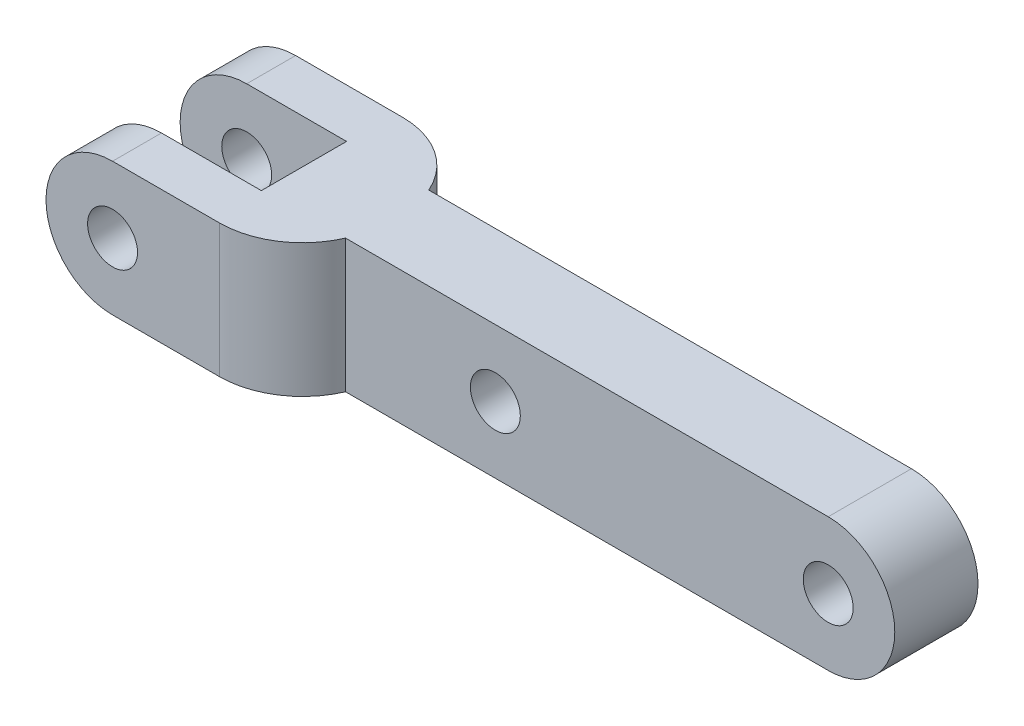
ISO-10303-21;
HEADER;
FILE_DESCRIPTION(('STEP AP214'),'2;1');
FILE_NAME('part.step','',(''),(''),'','','');
FILE_SCHEMA(('AUTOMOTIVE_DESIGN { 1 0 10303 214 1 1 1 1 }'));
ENDSEC;
DATA;
#1=APPLICATION_CONTEXT('core data for automotive mechanical design processes');
#2=APPLICATION_PROTOCOL_DEFINITION('international standard','automotive_design',2000,#1);
#3=PRODUCT_CONTEXT('',#1,'mechanical');
#4=PRODUCT('Part','Part','',(#3));
#5=PRODUCT_RELATED_PRODUCT_CATEGORY('part','',(#4));
#6=PRODUCT_DEFINITION_FORMATION('','',#4);
#7=PRODUCT_DEFINITION_CONTEXT('part definition',#1,'design');
#8=PRODUCT_DEFINITION('design','',#6,#7);
#9=PRODUCT_DEFINITION_SHAPE('','',#8);
#10=(LENGTH_UNIT() NAMED_UNIT(*) SI_UNIT(.MILLI.,.METRE.));
#11=(NAMED_UNIT(*) PLANE_ANGLE_UNIT() SI_UNIT($,.RADIAN.));
#12=(NAMED_UNIT(*) SI_UNIT($,.STERADIAN.) SOLID_ANGLE_UNIT());
#13=UNCERTAINTY_MEASURE_WITH_UNIT(LENGTH_MEASURE(1.E-05),#10,'distance_accuracy_value','');
#14=(GEOMETRIC_REPRESENTATION_CONTEXT(3) GLOBAL_UNCERTAINTY_ASSIGNED_CONTEXT((#13)) GLOBAL_UNIT_ASSIGNED_CONTEXT((#10,
#11,#12)) REPRESENTATION_CONTEXT('',''));
#15=CARTESIAN_POINT('',(0.,0.,0.));
#16=DIRECTION('',(0.,0.,1.));
#17=DIRECTION('',(1.,0.,0.));
#18=AXIS2_PLACEMENT_3D('',#15,#16,#17);
#19=CARTESIAN_POINT('',(-55.3769834102762,0.,0.));
#20=DIRECTION('',(0.,0.,1.));
#21=DIRECTION('',(1.,0.,0.));
#22=AXIS2_PLACEMENT_3D('',#19,#20,#21);
#23=CYLINDRICAL_SURFACE('',#22,4.);
#24=DIRECTION('',(0.,0.,1.));
#25=VECTOR('',#24,1.);
#26=CARTESIAN_POINT('',(-55.3769834102762,-4.,0.));
#27=LINE('',#26,#25);
#28=CARTESIAN_POINT('',(-55.3769834102762,-4.,-3.));
#29=VERTEX_POINT('',#28);
#30=CARTESIAN_POINT('',(-55.3769834102762,-4.,-0.0600000000000014));
#31=VERTEX_POINT('',#30);
#32=EDGE_CURVE('E218',#29,#31,#27,.T.);
#33=ORIENTED_EDGE('',*,*,#32,.T.);
#34=CARTESIAN_POINT('',(-55.3769834102762,0.,-0.0600000000000014));
#35=DIRECTION('',(0.,0.,-1.));
#36=DIRECTION('',(-1.,0.,0.));
#37=AXIS2_PLACEMENT_3D('',#34,#35,#36);
#38=CIRCLE('',#37,4.);
#39=CARTESIAN_POINT('',(-55.3769834102762,4.,-0.0600000000000014));
#40=VERTEX_POINT('',#39);
#41=EDGE_CURVE('E172',#40,#31,#38,.F.);
#42=ORIENTED_EDGE('',*,*,#41,.F.);
#43=DIRECTION('',(0.,0.,1.));
#44=VECTOR('',#43,1.);
#45=CARTESIAN_POINT('',(-55.3769834102762,3.99999999999999,0.));
#46=LINE('',#45,#44);
#47=CARTESIAN_POINT('',(-55.3769834102762,3.99999999999999,-3.));
#48=VERTEX_POINT('',#47);
#49=EDGE_CURVE('E224',#48,#40,#46,.T.);
#50=ORIENTED_EDGE('',*,*,#49,.F.);
#51=CARTESIAN_POINT('',(-55.3769834102762,0.,-3.));
#52=DIRECTION('',(0.,0.,1.));
#53=DIRECTION('',(1.,0.,0.));
#54=AXIS2_PLACEMENT_3D('',#51,#52,#53);
#55=CIRCLE('',#54,4.);
#56=EDGE_CURVE('E184',#48,#29,#55,.T.);
#57=ORIENTED_EDGE('',*,*,#56,.T.);
#58=EDGE_LOOP('',(#33,#42,#50,#57));
#59=FACE_BOUND('',#58,.T.);
#60=ADVANCED_FACE('F41',(#59),#23,.T.);
#61=CARTESIAN_POINT('',(-55.3769834102762,0.,0.));
#62=DIRECTION('',(0.,0.,1.));
#63=DIRECTION('',(1.,0.,0.));
#64=AXIS2_PLACEMENT_3D('',#61,#62,#63);
#65=CYLINDRICAL_SURFACE('',#64,1.5);
#66=CARTESIAN_POINT('',(-55.3769834102762,0.,-0.0600000000000014));
#67=DIRECTION('',(0.,0.,-1.));
#68=DIRECTION('',(-1.,0.,0.));
#69=AXIS2_PLACEMENT_3D('',#66,#67,#68);
#70=CIRCLE('',#69,1.5);
#71=CARTESIAN_POINT('',(-56.8769834102762,0.,-0.0600000000000012));
#72=VERTEX_POINT('',#71);
#73=EDGE_CURVE('E171',#72,#72,#70,.F.);
#74=ORIENTED_EDGE('',*,*,#73,.T.);
#75=EDGE_LOOP('',(#74));
#76=FACE_BOUND('',#75,.T.);
#77=CARTESIAN_POINT('',(-55.3769834102762,0.,-3.));
#78=DIRECTION('',(0.,0.,1.));
#79=DIRECTION('',(1.,0.,0.));
#80=AXIS2_PLACEMENT_3D('',#77,#78,#79);
#81=CIRCLE('',#80,1.5);
#82=CARTESIAN_POINT('',(-53.8769834102762,0.,-3.));
#83=VERTEX_POINT('',#82);
#84=EDGE_CURVE('E192',#83,#83,#81,.F.);
#85=ORIENTED_EDGE('',*,*,#84,.T.);
#86=EDGE_LOOP('',(#85));
#87=FACE_BOUND('',#86,.T.);
#88=ADVANCED_FACE('F323',(#76,#87),#65,.F.);
#89=CARTESIAN_POINT('',(-35.3769834102762,0.,5.));
#90=DIRECTION('',(0.,0.,1.));
#91=DIRECTION('',(1.,0.,0.));
#92=AXIS2_PLACEMENT_3D('',#89,#90,#91);
#93=PLANE('',#92);
#94=DIRECTION('',(0.,1.,0.));
#95=VECTOR('',#94,1.);
#96=CARTESIAN_POINT('',(-44.3769834102762,0.,5.));
#97=LINE('',#96,#95);
#98=CARTESIAN_POINT('',(-44.3769834102762,-4.,5.));
#99=VERTEX_POINT('',#98);
#100=CARTESIAN_POINT('',(-44.3769834102762,4.,5.));
#101=VERTEX_POINT('',#100);
#102=EDGE_CURVE('E213',#99,#101,#97,.T.);
#103=ORIENTED_EDGE('',*,*,#102,.F.);
#104=DIRECTION('',(1.,0.,0.));
#105=VECTOR('',#104,1.);
#106=CARTESIAN_POINT('',(-35.3769834102762,-4.,5.));
#107=LINE('',#106,#105);
#108=CARTESIAN_POINT('',(-15.3769834102762,-4.,5.));
#109=VERTEX_POINT('',#108);
#110=EDGE_CURVE('E243',#99,#109,#107,.T.);
#111=ORIENTED_EDGE('',*,*,#110,.T.);
#112=CARTESIAN_POINT('',(-15.3769834102762,0.,5.));
#113=DIRECTION('',(0.,0.,1.));
#114=DIRECTION('',(1.,0.,0.));
#115=AXIS2_PLACEMENT_3D('',#112,#113,#114);
#116=CIRCLE('',#115,4.);
#117=CARTESIAN_POINT('',(-15.3769834102762,4.,5.));
#118=VERTEX_POINT('',#117);
#119=EDGE_CURVE('E246',#109,#118,#116,.T.);
#120=ORIENTED_EDGE('',*,*,#119,.T.);
#121=DIRECTION('',(-1.,0.,0.));
#122=VECTOR('',#121,1.);
#123=CARTESIAN_POINT('',(-35.3769834102762,4.,5.));
#124=LINE('',#123,#122);
#125=EDGE_CURVE('E250',#118,#101,#124,.T.);
#126=ORIENTED_EDGE('',*,*,#125,.T.);
#127=EDGE_LOOP('',(#103,#111,#120,#126));
#128=FACE_BOUND('',#127,.T.);
#129=CARTESIAN_POINT('',(-35.3769834102762,0.,5.));
#130=DIRECTION('',(0.,0.,1.));
#131=DIRECTION('',(1.,0.,0.));
#132=AXIS2_PLACEMENT_3D('',#129,#130,#131);
#133=CIRCLE('',#132,1.5);
#134=CARTESIAN_POINT('',(-33.8769834102762,0.,5.));
#135=VERTEX_POINT('',#134);
#136=EDGE_CURVE('E235',#135,#135,#133,.T.);
#137=ORIENTED_EDGE('',*,*,#136,.F.);
#138=EDGE_LOOP('',(#137));
#139=FACE_BOUND('',#138,.T.);
#140=CARTESIAN_POINT('',(-15.3769834102762,0.,5.));
#141=DIRECTION('',(0.,0.,1.));
#142=DIRECTION('',(1.,0.,0.));
#143=AXIS2_PLACEMENT_3D('',#140,#141,#142);
#144=CIRCLE('',#143,1.5);
#145=CARTESIAN_POINT('',(-13.8769834102762,0.,5.));
#146=VERTEX_POINT('',#145);
#147=EDGE_CURVE('E227',#146,#146,#144,.T.);
#148=ORIENTED_EDGE('',*,*,#147,.F.);
#149=EDGE_LOOP('',(#148));
#150=FACE_BOUND('',#149,.T.);
#151=ADVANCED_FACE('F315',(#128,#139,#150),#93,.T.);
#152=CARTESIAN_POINT('',(-35.3769834102762,0.,0.));
#153=DIRECTION('',(0.,0.,1.));
#154=DIRECTION('',(1.,0.,0.));
#155=AXIS2_PLACEMENT_3D('',#152,#153,#154);
#156=PLANE('',#155);
#157=DIRECTION('',(1.,0.,0.));
#158=VECTOR('',#157,1.);
#159=CARTESIAN_POINT('',(-35.3769834102762,-4.,0.));
#160=LINE('',#159,#158);
#161=CARTESIAN_POINT('',(-44.3769834102762,-4.,0.));
#162=VERTEX_POINT('',#161);
#163=CARTESIAN_POINT('',(-15.3769834102762,-4.,0.));
#164=VERTEX_POINT('',#163);
#165=EDGE_CURVE('E239',#162,#164,#160,.T.);
#166=ORIENTED_EDGE('',*,*,#165,.F.);
#167=DIRECTION('',(0.,1.,0.));
#168=VECTOR('',#167,1.);
#169=CARTESIAN_POINT('',(-44.3769834102762,0.,0.));
#170=LINE('',#169,#168);
#171=CARTESIAN_POINT('',(-44.3769834102762,4.,0.));
#172=VERTEX_POINT('',#171);
#173=EDGE_CURVE('E210',#162,#172,#170,.T.);
#174=ORIENTED_EDGE('',*,*,#173,.T.);
#175=DIRECTION('',(-1.,0.,0.));
#176=VECTOR('',#175,1.);
#177=CARTESIAN_POINT('',(-35.3769834102762,4.,0.));
#178=LINE('',#177,#176);
#179=CARTESIAN_POINT('',(-15.3769834102762,4.,0.));
#180=VERTEX_POINT('',#179);
#181=EDGE_CURVE('E247',#180,#172,#178,.T.);
#182=ORIENTED_EDGE('',*,*,#181,.F.);
#183=CARTESIAN_POINT('',(-15.3769834102762,0.,0.));
#184=DIRECTION('',(0.,0.,1.));
#185=DIRECTION('',(1.,0.,0.));
#186=AXIS2_PLACEMENT_3D('',#183,#184,#185);
#187=CIRCLE('',#186,4.);
#188=EDGE_CURVE('E257',#164,#180,#187,.T.);
#189=ORIENTED_EDGE('',*,*,#188,.F.);
#190=EDGE_LOOP('',(#166,#174,#182,#189));
#191=FACE_BOUND('',#190,.T.);
#192=CARTESIAN_POINT('',(-35.3769834102762,0.,0.));
#193=DIRECTION('',(0.,0.,1.));
#194=DIRECTION('',(1.,0.,0.));
#195=AXIS2_PLACEMENT_3D('',#192,#193,#194);
#196=CIRCLE('',#195,1.5);
#197=CARTESIAN_POINT('',(-33.8769834102762,0.,0.));
#198=VERTEX_POINT('',#197);
#199=EDGE_CURVE('E231',#198,#198,#196,.T.);
#200=ORIENTED_EDGE('',*,*,#199,.T.);
#201=EDGE_LOOP('',(#200));
#202=FACE_BOUND('',#201,.T.);
#203=CARTESIAN_POINT('',(-15.3769834102762,0.,0.));
#204=DIRECTION('',(0.,0.,1.));
#205=DIRECTION('',(1.,0.,0.));
#206=AXIS2_PLACEMENT_3D('',#203,#204,#205);
#207=CIRCLE('',#206,1.5);
#208=CARTESIAN_POINT('',(-13.8769834102762,0.,0.));
#209=VERTEX_POINT('',#208);
#210=EDGE_CURVE('E222',#209,#209,#207,.T.);
#211=ORIENTED_EDGE('',*,*,#210,.T.);
#212=EDGE_LOOP('',(#211));
#213=FACE_BOUND('',#212,.T.);
#214=ADVANCED_FACE('F305',(#191,#202,#213),#156,.F.);
#215=CARTESIAN_POINT('',(-35.3769834102762,-4.,5.));
#216=DIRECTION('',(0.,1.,0.));
#217=DIRECTION('',(-1.,0.,0.));
#218=AXIS2_PLACEMENT_3D('',#215,#216,#217);
#219=PLANE('',#218);
#220=DIRECTION('',(1.,0.,0.));
#221=VECTOR('',#220,1.);
#222=CARTESIAN_POINT('',(0.,-4.,-3.));
#223=LINE('',#222,#221);
#224=CARTESIAN_POINT('',(-48.959559105232,-4.,-3.));
#225=VERTEX_POINT('',#224);
#226=EDGE_CURVE('E188',#29,#225,#223,.T.);
#227=ORIENTED_EDGE('',*,*,#226,.T.);
#228=CARTESIAN_POINT('',(-48.959559105232,-4.,2.));
#229=DIRECTION('',(0.,1.,0.));
#230=DIRECTION('',(-1.,0.,0.));
#231=AXIS2_PLACEMENT_3D('',#228,#229,#230);
#232=CIRCLE('',#231,5.);
#233=EDGE_CURVE('E281',#225,#162,#232,.F.);
#234=ORIENTED_EDGE('',*,*,#233,.T.);
#235=ORIENTED_EDGE('',*,*,#165,.T.);
#236=DIRECTION('',(0.,0.,-1.));
#237=VECTOR('',#236,1.);
#238=CARTESIAN_POINT('',(-15.3769834102762,-4.,5.));
#239=LINE('',#238,#237);
#240=EDGE_CURVE('E265',#109,#164,#239,.T.);
#241=ORIENTED_EDGE('',*,*,#240,.F.);
#242=ORIENTED_EDGE('',*,*,#110,.F.);
#243=CARTESIAN_POINT('',(-48.959559105232,-4.,3.));
#244=DIRECTION('',(0.,1.,0.));
#245=DIRECTION('',(-1.,0.,0.));
#246=AXIS2_PLACEMENT_3D('',#243,#244,#245);
#247=CIRCLE('',#246,5.);
#248=CARTESIAN_POINT('',(-48.959559105232,-4.,8.));
#249=VERTEX_POINT('',#248);
#250=EDGE_CURVE('E63',#99,#249,#247,.F.);
#251=ORIENTED_EDGE('',*,*,#250,.T.);
#252=DIRECTION('',(1.,0.,0.));
#253=VECTOR('',#252,1.);
#254=CARTESIAN_POINT('',(0.,-4.,8.));
#255=LINE('',#254,#253);
#256=CARTESIAN_POINT('',(-55.3769834102762,-4.,8.));
#257=VERTEX_POINT('',#256);
#258=EDGE_CURVE('E203',#257,#249,#255,.T.);
#259=ORIENTED_EDGE('',*,*,#258,.F.);
#260=CARTESIAN_POINT('',(-55.3769834102762,-4.,5.06));
#261=VERTEX_POINT('',#260);
#262=EDGE_CURVE('E223',#261,#257,#27,.T.);
#263=ORIENTED_EDGE('',*,*,#262,.F.);
#264=DIRECTION('',(1.,0.,0.));
#265=VECTOR('',#264,1.);
#266=CARTESIAN_POINT('',(-35.3769834102762,-4.,5.06));
#267=LINE('',#266,#265);
#268=CARTESIAN_POINT('',(-49.3769834102762,-4.,5.06));
#269=VERTEX_POINT('',#268);
#270=EDGE_CURVE('E168',#261,#269,#267,.T.);
#271=ORIENTED_EDGE('',*,*,#270,.T.);
#272=DIRECTION('',(0.,0.,-1.));
#273=VECTOR('',#272,1.);
#274=CARTESIAN_POINT('',(-49.3769834102762,-4.,5.));
#275=LINE('',#274,#273);
#276=CARTESIAN_POINT('',(-49.3769834102762,-4.,-0.0600000000000019));
#277=VERTEX_POINT('',#276);
#278=EDGE_CURVE('E138',#269,#277,#275,.T.);
#279=ORIENTED_EDGE('',*,*,#278,.T.);
#280=DIRECTION('',(-1.,0.,0.));
#281=VECTOR('',#280,1.);
#282=CARTESIAN_POINT('',(-35.3769834102762,-4.,-0.0600000000000028));
#283=LINE('',#282,#281);
#284=EDGE_CURVE('E175',#277,#31,#283,.T.);
#285=ORIENTED_EDGE('',*,*,#284,.T.);
#286=ORIENTED_EDGE('',*,*,#32,.F.);
#287=EDGE_LOOP('',(#227,#234,#235,#241,#242,#251,#259,#263,#271,#279,#285,#286));
#288=FACE_BOUND('',#287,.T.);
#289=ADVANCED_FACE('F301',(#288),#219,.F.);
#290=CARTESIAN_POINT('',(-15.3769834102762,0.,5.));
#291=DIRECTION('',(0.,0.,-1.));
#292=DIRECTION('',(-1.,0.,0.));
#293=AXIS2_PLACEMENT_3D('',#290,#291,#292);
#294=CYLINDRICAL_SURFACE('',#293,4.);
#295=ORIENTED_EDGE('',*,*,#188,.T.);
#296=DIRECTION('',(0.,0.,-1.));
#297=VECTOR('',#296,1.);
#298=CARTESIAN_POINT('',(-15.3769834102762,4.,5.));
#299=LINE('',#298,#297);
#300=EDGE_CURVE('E254',#118,#180,#299,.T.);
#301=ORIENTED_EDGE('',*,*,#300,.F.);
#302=ORIENTED_EDGE('',*,*,#119,.F.);
#303=ORIENTED_EDGE('',*,*,#240,.T.);
#304=EDGE_LOOP('',(#295,#301,#302,#303));
#305=FACE_BOUND('',#304,.T.);
#306=ADVANCED_FACE('F309',(#305),#294,.T.);
#307=CARTESIAN_POINT('',(-35.3769834102762,4.,5.));
#308=DIRECTION('',(0.,-1.,0.));
#309=DIRECTION('',(1.,0.,0.));
#310=AXIS2_PLACEMENT_3D('',#307,#308,#309);
#311=PLANE('',#310);
#312=ORIENTED_EDGE('',*,*,#181,.T.);
#313=CARTESIAN_POINT('',(-48.959559105232,4.,2.));
#314=DIRECTION('',(0.,-1.,0.));
#315=DIRECTION('',(1.,0.,0.));
#316=AXIS2_PLACEMENT_3D('',#313,#314,#315);
#317=CIRCLE('',#316,5.);
#318=CARTESIAN_POINT('',(-48.959559105232,4.,-3.));
#319=VERTEX_POINT('',#318);
#320=EDGE_CURVE('E50',#172,#319,#317,.F.);
#321=ORIENTED_EDGE('',*,*,#320,.T.);
#322=DIRECTION('',(-1.,0.,0.));
#323=VECTOR('',#322,1.);
#324=CARTESIAN_POINT('',(0.,4.,-3.));
#325=LINE('',#324,#323);
#326=EDGE_CURVE('E181',#319,#48,#325,.T.);
#327=ORIENTED_EDGE('',*,*,#326,.T.);
#328=ORIENTED_EDGE('',*,*,#49,.T.);
#329=DIRECTION('',(-1.,0.,0.));
#330=VECTOR('',#329,1.);
#331=CARTESIAN_POINT('',(-59.3769834102762,4.,-0.060000000000001));
#332=LINE('',#331,#330);
#333=CARTESIAN_POINT('',(-49.3769834102762,4.,-0.0600000000000019));
#334=VERTEX_POINT('',#333);
#335=EDGE_CURVE('E144',#334,#40,#332,.T.);
#336=ORIENTED_EDGE('',*,*,#335,.F.);
#337=DIRECTION('',(0.,0.,-1.));
#338=VECTOR('',#337,1.);
#339=CARTESIAN_POINT('',(-49.3769834102762,4.,5.06));
#340=LINE('',#339,#338);
#341=CARTESIAN_POINT('',(-49.3769834102762,4.,5.06));
#342=VERTEX_POINT('',#341);
#343=EDGE_CURVE('E135',#342,#334,#340,.T.);
#344=ORIENTED_EDGE('',*,*,#343,.F.);
#345=DIRECTION('',(1.,0.,0.));
#346=VECTOR('',#345,1.);
#347=CARTESIAN_POINT('',(-59.3769834102762,4.,5.06));
#348=LINE('',#347,#346);
#349=CARTESIAN_POINT('',(-55.3769834102762,4.,5.06));
#350=VERTEX_POINT('',#349);
#351=EDGE_CURVE('E147',#350,#342,#348,.T.);
#352=ORIENTED_EDGE('',*,*,#351,.F.);
#353=CARTESIAN_POINT('',(-55.3769834102762,3.99999999999999,8.));
#354=VERTEX_POINT('',#353);
#355=EDGE_CURVE('E217',#350,#354,#46,.T.);
#356=ORIENTED_EDGE('',*,*,#355,.T.);
#357=DIRECTION('',(-1.,0.,0.));
#358=VECTOR('',#357,1.);
#359=CARTESIAN_POINT('',(0.,4.,8.));
#360=LINE('',#359,#358);
#361=CARTESIAN_POINT('',(-48.959559105232,4.,8.));
#362=VERTEX_POINT('',#361);
#363=EDGE_CURVE('E196',#362,#354,#360,.T.);
#364=ORIENTED_EDGE('',*,*,#363,.F.);
#365=CARTESIAN_POINT('',(-48.959559105232,4.,3.));
#366=DIRECTION('',(0.,-1.,0.));
#367=DIRECTION('',(1.,0.,0.));
#368=AXIS2_PLACEMENT_3D('',#365,#366,#367);
#369=CIRCLE('',#368,5.);
#370=EDGE_CURVE('E284',#362,#101,#369,.F.);
#371=ORIENTED_EDGE('',*,*,#370,.T.);
#372=ORIENTED_EDGE('',*,*,#125,.F.);
#373=ORIENTED_EDGE('',*,*,#300,.T.);
#374=EDGE_LOOP('',(#312,#321,#327,#328,#336,#344,#352,#356,#364,#371,#372,#373));
#375=FACE_BOUND('',#374,.T.);
#376=ADVANCED_FACE('F156',(#375),#311,.F.);
#377=CARTESIAN_POINT('',(-35.3769834102762,0.,5.));
#378=DIRECTION('',(0.,0.,-1.));
#379=DIRECTION('',(-1.,0.,0.));
#380=AXIS2_PLACEMENT_3D('',#377,#378,#379);
#381=CYLINDRICAL_SURFACE('',#380,1.5);
#382=ORIENTED_EDGE('',*,*,#136,.T.);
#383=EDGE_LOOP('',(#382));
#384=FACE_BOUND('',#383,.T.);
#385=ORIENTED_EDGE('',*,*,#199,.F.);
#386=EDGE_LOOP('',(#385));
#387=FACE_BOUND('',#386,.T.);
#388=ADVANCED_FACE('F342',(#384,#387),#381,.F.);
#389=CARTESIAN_POINT('',(-15.3769834102762,0.,5.));
#390=DIRECTION('',(0.,0.,-1.));
#391=DIRECTION('',(-1.,0.,0.));
#392=AXIS2_PLACEMENT_3D('',#389,#390,#391);
#393=CYLINDRICAL_SURFACE('',#392,1.5);
#394=ORIENTED_EDGE('',*,*,#147,.T.);
#395=EDGE_LOOP('',(#394));
#396=FACE_BOUND('',#395,.T.);
#397=ORIENTED_EDGE('',*,*,#210,.F.);
#398=EDGE_LOOP('',(#397));
#399=FACE_BOUND('',#398,.T.);
#400=ADVANCED_FACE('F335',(#396,#399),#393,.F.);
#401=CARTESIAN_POINT('',(-55.3769834102762,0.,5.06));
#402=DIRECTION('',(0.,0.,1.));
#403=DIRECTION('',(1.,0.,0.));
#404=AXIS2_PLACEMENT_3D('',#401,#402,#403);
#405=CIRCLE('',#404,4.);
#406=EDGE_CURVE('E149',#261,#350,#405,.F.);
#407=ORIENTED_EDGE('',*,*,#406,.F.);
#408=ORIENTED_EDGE('',*,*,#262,.T.);
#409=CARTESIAN_POINT('',(-55.3769834102762,0.,8.));
#410=DIRECTION('',(0.,0.,1.));
#411=DIRECTION('',(1.,0.,0.));
#412=AXIS2_PLACEMENT_3D('',#409,#410,#411);
#413=CIRCLE('',#412,4.);
#414=EDGE_CURVE('E199',#354,#257,#413,.T.);
#415=ORIENTED_EDGE('',*,*,#414,.F.);
#416=ORIENTED_EDGE('',*,*,#355,.F.);
#417=EDGE_LOOP('',(#407,#408,#415,#416));
#418=FACE_BOUND('',#417,.T.);
#419=ADVANCED_FACE('F326',(#418),#23,.T.);
#420=CARTESIAN_POINT('',(0.,0.,-3.));
#421=DIRECTION('',(0.,0.,1.));
#422=DIRECTION('',(1.,0.,0.));
#423=AXIS2_PLACEMENT_3D('',#420,#421,#422);
#424=PLANE('',#423);
#425=ORIENTED_EDGE('',*,*,#326,.F.);
#426=DIRECTION('',(0.,-1.,0.));
#427=VECTOR('',#426,1.);
#428=CARTESIAN_POINT('',(-48.959559105232,0.,-3.));
#429=LINE('',#428,#427);
#430=EDGE_CURVE('E269',#319,#225,#429,.T.);
#431=ORIENTED_EDGE('',*,*,#430,.T.);
#432=ORIENTED_EDGE('',*,*,#226,.F.);
#433=ORIENTED_EDGE('',*,*,#56,.F.);
#434=EDGE_LOOP('',(#425,#431,#432,#433));
#435=FACE_BOUND('',#434,.T.);
#436=ORIENTED_EDGE('',*,*,#84,.F.);
#437=EDGE_LOOP('',(#436));
#438=FACE_BOUND('',#437,.T.);
#439=ADVANCED_FACE('F296',(#435,#438),#424,.F.);
#440=CARTESIAN_POINT('',(-55.3769834102762,0.,5.06));
#441=DIRECTION('',(0.,0.,1.));
#442=DIRECTION('',(1.,0.,0.));
#443=AXIS2_PLACEMENT_3D('',#440,#441,#442);
#444=CIRCLE('',#443,1.5);
#445=CARTESIAN_POINT('',(-53.8769834102762,0.,5.06));
#446=VERTEX_POINT('',#445);
#447=EDGE_CURVE('E164',#446,#446,#444,.F.);
#448=ORIENTED_EDGE('',*,*,#447,.T.);
#449=EDGE_LOOP('',(#448));
#450=FACE_BOUND('',#449,.T.);
#451=CARTESIAN_POINT('',(-55.3769834102762,0.,8.));
#452=DIRECTION('',(0.,0.,1.));
#453=DIRECTION('',(1.,0.,0.));
#454=AXIS2_PLACEMENT_3D('',#451,#452,#453);
#455=CIRCLE('',#454,1.5);
#456=CARTESIAN_POINT('',(-53.8769834102762,0.,8.));
#457=VERTEX_POINT('',#456);
#458=EDGE_CURVE('E206',#457,#457,#455,.F.);
#459=ORIENTED_EDGE('',*,*,#458,.F.);
#460=EDGE_LOOP('',(#459));
#461=FACE_BOUND('',#460,.T.);
#462=ADVANCED_FACE('F332',(#450,#461),#65,.F.);
#463=CARTESIAN_POINT('',(0.,0.,8.));
#464=DIRECTION('',(0.,0.,1.));
#465=DIRECTION('',(1.,0.,0.));
#466=AXIS2_PLACEMENT_3D('',#463,#464,#465);
#467=PLANE('',#466);
#468=ORIENTED_EDGE('',*,*,#258,.T.);
#469=DIRECTION('',(0.,1.,0.));
#470=VECTOR('',#469,1.);
#471=CARTESIAN_POINT('',(-48.959559105232,4.,8.));
#472=LINE('',#471,#470);
#473=EDGE_CURVE('E11',#249,#362,#472,.T.);
#474=ORIENTED_EDGE('',*,*,#473,.T.);
#475=ORIENTED_EDGE('',*,*,#363,.T.);
#476=ORIENTED_EDGE('',*,*,#414,.T.);
#477=EDGE_LOOP('',(#468,#474,#475,#476));
#478=FACE_BOUND('',#477,.T.);
#479=ORIENTED_EDGE('',*,*,#458,.T.);
#480=EDGE_LOOP('',(#479));
#481=FACE_BOUND('',#480,.T.);
#482=ADVANCED_FACE('F349',(#478,#481),#467,.T.);
#483=CARTESIAN_POINT('',(-49.3769834102762,-6.,5.06));
#484=DIRECTION('',(1.,0.,0.));
#485=DIRECTION('',(0.,1.,0.));
#486=AXIS2_PLACEMENT_3D('',#483,#484,#485);
#487=PLANE('',#486);
#488=DIRECTION('',(0.,1.,0.));
#489=VECTOR('',#488,1.);
#490=CARTESIAN_POINT('',(-49.3769834102762,-6.,5.06));
#491=LINE('',#490,#489);
#492=EDGE_CURVE('E130',#269,#342,#491,.T.);
#493=ORIENTED_EDGE('',*,*,#492,.T.);
#494=ORIENTED_EDGE('',*,*,#343,.T.);
#495=DIRECTION('',(0.,1.,0.));
#496=VECTOR('',#495,1.);
#497=CARTESIAN_POINT('',(-49.3769834102762,-6.,-0.0600000000000019));
#498=LINE('',#497,#496);
#499=EDGE_CURVE('E143',#277,#334,#498,.T.);
#500=ORIENTED_EDGE('',*,*,#499,.F.);
#501=ORIENTED_EDGE('',*,*,#278,.F.);
#502=EDGE_LOOP('',(#493,#494,#500,#501));
#503=FACE_BOUND('',#502,.T.);
#504=ADVANCED_FACE('F132',(#503),#487,.F.);
#505=CARTESIAN_POINT('',(-59.3769834102762,-6.,-0.060000000000001));
#506=DIRECTION('',(0.,0.,-1.));
#507=DIRECTION('',(-1.,0.,0.));
#508=AXIS2_PLACEMENT_3D('',#505,#506,#507);
#509=PLANE('',#508);
#510=ORIENTED_EDGE('',*,*,#73,.F.);
#511=EDGE_LOOP('',(#510));
#512=FACE_BOUND('',#511,.T.);
#513=ORIENTED_EDGE('',*,*,#499,.T.);
#514=ORIENTED_EDGE('',*,*,#335,.T.);
#515=ORIENTED_EDGE('',*,*,#41,.T.);
#516=ORIENTED_EDGE('',*,*,#284,.F.);
#517=EDGE_LOOP('',(#513,#514,#515,#516));
#518=FACE_BOUND('',#517,.T.);
#519=ADVANCED_FACE('F427',(#512,#518),#509,.F.);
#520=CARTESIAN_POINT('',(-59.3769834102762,-6.,5.06));
#521=DIRECTION('',(0.,0.,1.));
#522=DIRECTION('',(1.,0.,0.));
#523=AXIS2_PLACEMENT_3D('',#520,#521,#522);
#524=PLANE('',#523);
#525=ORIENTED_EDGE('',*,*,#447,.F.);
#526=EDGE_LOOP('',(#525));
#527=FACE_BOUND('',#526,.T.);
#528=ORIENTED_EDGE('',*,*,#270,.F.);
#529=ORIENTED_EDGE('',*,*,#406,.T.);
#530=ORIENTED_EDGE('',*,*,#351,.T.);
#531=ORIENTED_EDGE('',*,*,#492,.F.);
#532=EDGE_LOOP('',(#528,#529,#530,#531));
#533=FACE_BOUND('',#532,.T.);
#534=ADVANCED_FACE('F148',(#527,#533),#524,.F.);
#535=CARTESIAN_POINT('',(-48.959559105232,0.,2.));
#536=DIRECTION('',(0.,-1.,0.));
#537=DIRECTION('',(0.,0.,-1.));
#538=AXIS2_PLACEMENT_3D('',#535,#536,#537);
#539=CYLINDRICAL_SURFACE('',#538,5.);
#540=ORIENTED_EDGE('',*,*,#320,.F.);
#541=ORIENTED_EDGE('',*,*,#173,.F.);
#542=ORIENTED_EDGE('',*,*,#233,.F.);
#543=ORIENTED_EDGE('',*,*,#430,.F.);
#544=EDGE_LOOP('',(#540,#541,#542,#543));
#545=FACE_BOUND('',#544,.T.);
#546=ADVANCED_FACE('F299',(#545),#539,.T.);
#547=CARTESIAN_POINT('',(-48.959559105232,0.,3.));
#548=DIRECTION('',(0.,-1.,0.));
#549=DIRECTION('',(0.,0.,-1.));
#550=AXIS2_PLACEMENT_3D('',#547,#548,#549);
#551=CYLINDRICAL_SURFACE('',#550,5.);
#552=ORIENTED_EDGE('',*,*,#370,.F.);
#553=ORIENTED_EDGE('',*,*,#473,.F.);
#554=ORIENTED_EDGE('',*,*,#250,.F.);
#555=ORIENTED_EDGE('',*,*,#102,.T.);
#556=EDGE_LOOP('',(#552,#553,#554,#555));
#557=FACE_BOUND('',#556,.T.);
#558=ADVANCED_FACE('F43',(#557),#551,.T.);
#559=CLOSED_SHELL('',(#60,#88,#151,#214,#289,#306,#376,#388,#400,#419,#439,#462,#482,#504,#519,
#534,#546,#558));
#560=MANIFOLD_SOLID_BREP('B2',#559);
#561=ADVANCED_BREP_SHAPE_REPRESENTATION('',(#18,#560),#14);
#562=SHAPE_DEFINITION_REPRESENTATION(#9,#561);
ENDSEC;
END-ISO-10303-21;
